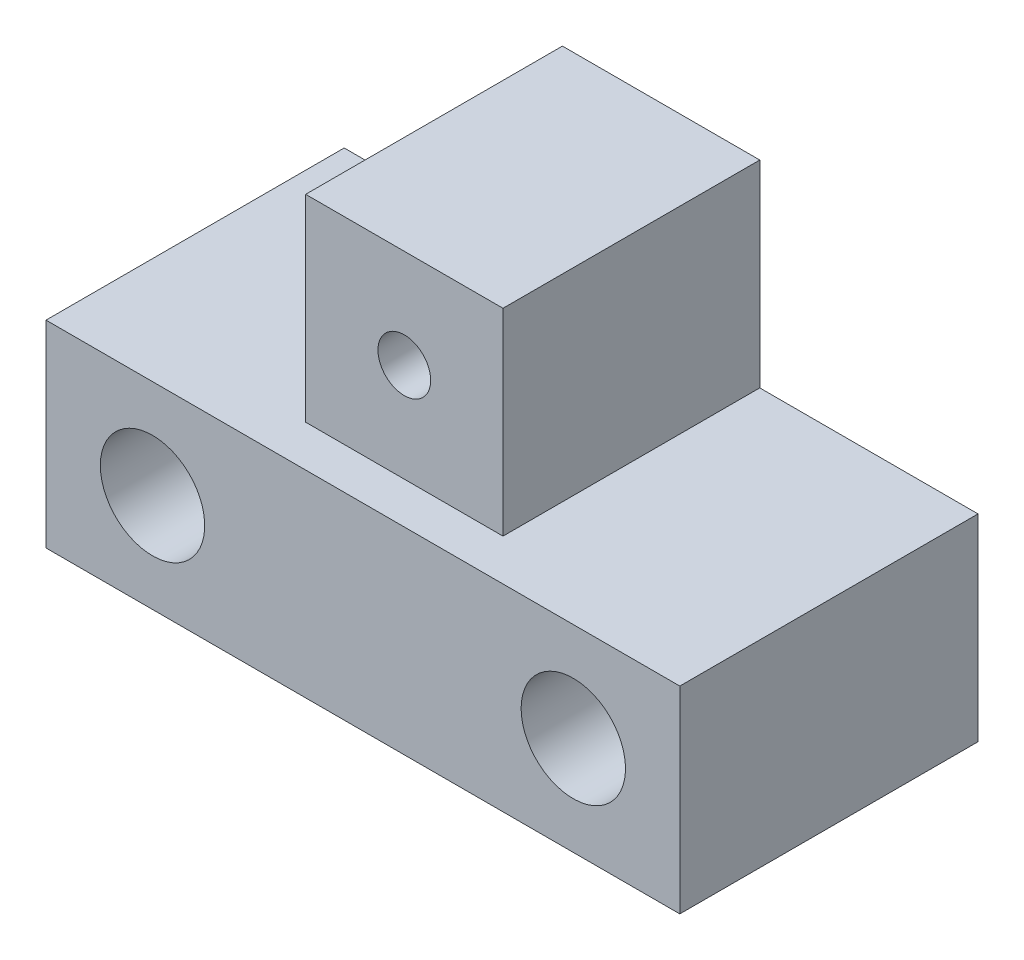
ISO-10303-21;
HEADER;
FILE_DESCRIPTION(('STEP AP214'),'2;1');
FILE_NAME('part.step','',(''),(''),'','','');
FILE_SCHEMA(('AUTOMOTIVE_DESIGN { 1 0 10303 214 1 1 1 1 }'));
ENDSEC;
DATA;
#1=APPLICATION_CONTEXT('core data for automotive mechanical design processes');
#2=APPLICATION_PROTOCOL_DEFINITION('international standard','automotive_design',2000,#1);
#3=PRODUCT_CONTEXT('',#1,'mechanical');
#4=PRODUCT('Part','Part','',(#3));
#5=PRODUCT_RELATED_PRODUCT_CATEGORY('part','',(#4));
#6=PRODUCT_DEFINITION_FORMATION('','',#4);
#7=PRODUCT_DEFINITION_CONTEXT('part definition',#1,'design');
#8=PRODUCT_DEFINITION('design','',#6,#7);
#9=PRODUCT_DEFINITION_SHAPE('','',#8);
#10=(LENGTH_UNIT() NAMED_UNIT(*) SI_UNIT(.MILLI.,.METRE.));
#11=(NAMED_UNIT(*) PLANE_ANGLE_UNIT() SI_UNIT($,.RADIAN.));
#12=(NAMED_UNIT(*) SI_UNIT($,.STERADIAN.) SOLID_ANGLE_UNIT());
#13=UNCERTAINTY_MEASURE_WITH_UNIT(LENGTH_MEASURE(1.E-05),#10,'distance_accuracy_value','');
#14=(GEOMETRIC_REPRESENTATION_CONTEXT(3) GLOBAL_UNCERTAINTY_ASSIGNED_CONTEXT((#13)) GLOBAL_UNIT_ASSIGNED_CONTEXT((#10,
#11,#12)) REPRESENTATION_CONTEXT('',''));
#15=CARTESIAN_POINT('',(0.,0.,0.));
#16=DIRECTION('',(0.,0.,1.));
#17=DIRECTION('',(1.,0.,0.));
#18=AXIS2_PLACEMENT_3D('',#15,#16,#17);
#19=CARTESIAN_POINT('',(0.,0.,9.));
#20=DIRECTION('',(0.,0.,-1.));
#21=DIRECTION('',(-1.,0.,0.));
#22=AXIS2_PLACEMENT_3D('',#19,#20,#21);
#23=PLANE('',#22);
#24=CARTESIAN_POINT('',(15.915,2.97828432001349,9.));
#25=DIRECTION('',(0.,0.,-1.));
#26=DIRECTION('',(-1.,0.,0.));
#27=AXIS2_PLACEMENT_3D('',#24,#25,#26);
#28=CIRCLE('',#27,1.575);
#29=CARTESIAN_POINT('',(14.34,2.97828432001349,9.));
#30=VERTEX_POINT('',#29);
#31=EDGE_CURVE('E176',#30,#30,#28,.T.);
#32=ORIENTED_EDGE('',*,*,#31,.T.);
#33=EDGE_LOOP('',(#32));
#34=FACE_BOUND('',#33,.T.);
#35=CARTESIAN_POINT('',(3.215,2.97828432001349,9.));
#36=DIRECTION('',(0.,0.,-1.));
#37=DIRECTION('',(-1.,0.,0.));
#38=AXIS2_PLACEMENT_3D('',#35,#36,#37);
#39=CIRCLE('',#38,1.575);
#40=CARTESIAN_POINT('',(1.64,2.97828432001349,9.));
#41=VERTEX_POINT('',#40);
#42=EDGE_CURVE('E125',#41,#41,#39,.T.);
#43=ORIENTED_EDGE('',*,*,#42,.T.);
#44=EDGE_LOOP('',(#43));
#45=FACE_BOUND('',#44,.T.);
#46=DIRECTION('',(-1.,0.,0.));
#47=VECTOR('',#46,1.);
#48=CARTESIAN_POINT('',(12.5432843200135,5.95656864002698,9.));
#49=LINE('',#48,#47);
#50=CARTESIAN_POINT('',(19.13,5.95656864002698,9.));
#51=VERTEX_POINT('',#50);
#52=CARTESIAN_POINT('',(0.,5.95656864002698,9.));
#53=VERTEX_POINT('',#52);
#54=EDGE_CURVE('E165',#51,#53,#49,.T.);
#55=ORIENTED_EDGE('',*,*,#54,.T.);
#56=DIRECTION('',(0.,-1.,0.));
#57=VECTOR('',#56,1.);
#58=CARTESIAN_POINT('',(0.,0.,9.));
#59=LINE('',#58,#57);
#60=CARTESIAN_POINT('',(0.,0.,9.));
#61=VERTEX_POINT('',#60);
#62=EDGE_CURVE('E62',#53,#61,#59,.T.);
#63=ORIENTED_EDGE('',*,*,#62,.T.);
#64=DIRECTION('',(1.,0.,0.));
#65=VECTOR('',#64,1.);
#66=CARTESIAN_POINT('',(19.13,0.,9.));
#67=LINE('',#66,#65);
#68=CARTESIAN_POINT('',(19.13,0.,9.));
#69=VERTEX_POINT('',#68);
#70=EDGE_CURVE('E146',#61,#69,#67,.T.);
#71=ORIENTED_EDGE('',*,*,#70,.T.);
#72=DIRECTION('',(0.,1.,0.));
#73=VECTOR('',#72,1.);
#74=CARTESIAN_POINT('',(19.13,5.95656864002698,9.));
#75=LINE('',#74,#73);
#76=EDGE_CURVE('E100',#69,#51,#75,.T.);
#77=ORIENTED_EDGE('',*,*,#76,.T.);
#78=EDGE_LOOP('',(#55,#63,#71,#77));
#79=FACE_BOUND('',#78,.T.);
#80=ADVANCED_FACE('F37',(#34,#45,#79),#23,.F.);
#81=CARTESIAN_POINT('',(0.,0.,0.));
#82=DIRECTION('',(0.,0.,-1.));
#83=DIRECTION('',(-1.,0.,0.));
#84=AXIS2_PLACEMENT_3D('',#81,#82,#83);
#85=PLANE('',#84);
#86=CARTESIAN_POINT('',(15.915,2.97828432001349,0.));
#87=DIRECTION('',(0.,0.,-1.));
#88=DIRECTION('',(-1.,0.,0.));
#89=AXIS2_PLACEMENT_3D('',#86,#87,#88);
#90=CIRCLE('',#89,1.575);
#91=CARTESIAN_POINT('',(14.34,2.97828432001349,0.));
#92=VERTEX_POINT('',#91);
#93=EDGE_CURVE('E179',#92,#92,#90,.T.);
#94=ORIENTED_EDGE('',*,*,#93,.F.);
#95=EDGE_LOOP('',(#94));
#96=FACE_BOUND('',#95,.T.);
#97=CARTESIAN_POINT('',(3.215,2.97828432001349,0.));
#98=DIRECTION('',(0.,0.,-1.));
#99=DIRECTION('',(-1.,0.,0.));
#100=AXIS2_PLACEMENT_3D('',#97,#98,#99);
#101=CIRCLE('',#100,1.575);
#102=CARTESIAN_POINT('',(1.64,2.97828432001349,0.));
#103=VERTEX_POINT('',#102);
#104=EDGE_CURVE('E173',#103,#103,#101,.T.);
#105=ORIENTED_EDGE('',*,*,#104,.F.);
#106=EDGE_LOOP('',(#105));
#107=FACE_BOUND('',#106,.T.);
#108=DIRECTION('',(1.,0.,0.));
#109=VECTOR('',#108,1.);
#110=CARTESIAN_POINT('',(19.13,0.,0.));
#111=LINE('',#110,#109);
#112=CARTESIAN_POINT('',(0.,0.,0.));
#113=VERTEX_POINT('',#112);
#114=CARTESIAN_POINT('',(19.13,0.,0.));
#115=VERTEX_POINT('',#114);
#116=EDGE_CURVE('E160',#113,#115,#111,.T.);
#117=ORIENTED_EDGE('',*,*,#116,.F.);
#118=DIRECTION('',(0.,-1.,0.));
#119=VECTOR('',#118,1.);
#120=CARTESIAN_POINT('',(0.,0.,0.));
#121=LINE('',#120,#119);
#122=CARTESIAN_POINT('',(0.,5.95656864002698,0.));
#123=VERTEX_POINT('',#122);
#124=EDGE_CURVE('E93',#123,#113,#121,.T.);
#125=ORIENTED_EDGE('',*,*,#124,.F.);
#126=DIRECTION('',(-1.,0.,0.));
#127=VECTOR('',#126,1.);
#128=CARTESIAN_POINT('',(0.,5.95656864002698,0.));
#129=LINE('',#128,#127);
#130=CARTESIAN_POINT('',(6.58671567998651,5.95656864002698,0.));
#131=VERTEX_POINT('',#130);
#132=EDGE_CURVE('E147',#131,#123,#129,.T.);
#133=ORIENTED_EDGE('',*,*,#132,.F.);
#134=DIRECTION('',(0.,-1.,0.));
#135=VECTOR('',#134,1.);
#136=CARTESIAN_POINT('',(6.58671567998651,5.95656864002698,0.));
#137=LINE('',#136,#135);
#138=CARTESIAN_POINT('',(6.58671567998651,11.913137280054,0.));
#139=VERTEX_POINT('',#138);
#140=EDGE_CURVE('E149',#139,#131,#137,.T.);
#141=ORIENTED_EDGE('',*,*,#140,.F.);
#142=DIRECTION('',(-1.,0.,0.));
#143=VECTOR('',#142,1.);
#144=CARTESIAN_POINT('',(6.58671567998651,11.913137280054,0.));
#145=LINE('',#144,#143);
#146=CARTESIAN_POINT('',(12.5432843200135,11.913137280054,0.));
#147=VERTEX_POINT('',#146);
#148=EDGE_CURVE('E152',#147,#139,#145,.T.);
#149=ORIENTED_EDGE('',*,*,#148,.F.);
#150=DIRECTION('',(0.,1.,0.));
#151=VECTOR('',#150,1.);
#152=CARTESIAN_POINT('',(12.5432843200135,11.913137280054,0.));
#153=LINE('',#152,#151);
#154=CARTESIAN_POINT('',(12.5432843200135,5.95656864002698,0.));
#155=VERTEX_POINT('',#154);
#156=EDGE_CURVE('E155',#155,#147,#153,.T.);
#157=ORIENTED_EDGE('',*,*,#156,.F.);
#158=DIRECTION('',(-1.,0.,0.));
#159=VECTOR('',#158,1.);
#160=CARTESIAN_POINT('',(12.5432843200135,5.95656864002698,0.));
#161=LINE('',#160,#159);
#162=CARTESIAN_POINT('',(19.13,5.95656864002698,0.));
#163=VERTEX_POINT('',#162);
#164=EDGE_CURVE('E131',#163,#155,#161,.T.);
#165=ORIENTED_EDGE('',*,*,#164,.F.);
#166=DIRECTION('',(0.,1.,0.));
#167=VECTOR('',#166,1.);
#168=CARTESIAN_POINT('',(19.13,5.95656864002698,0.));
#169=LINE('',#168,#167);
#170=EDGE_CURVE('E158',#115,#163,#169,.T.);
#171=ORIENTED_EDGE('',*,*,#170,.F.);
#172=EDGE_LOOP('',(#117,#125,#133,#141,#149,#157,#165,#171));
#173=FACE_BOUND('',#172,.T.);
#174=CARTESIAN_POINT('',(9.565,8.93485296004046,0.));
#175=DIRECTION('',(0.,0.,1.));
#176=DIRECTION('',(1.,0.,0.));
#177=AXIS2_PLACEMENT_3D('',#174,#175,#176);
#178=CIRCLE('',#177,0.795000000000001);
#179=CARTESIAN_POINT('',(10.36,8.93485296004046,0.));
#180=VERTEX_POINT('',#179);
#181=EDGE_CURVE('E163',#180,#180,#178,.T.);
#182=ORIENTED_EDGE('',*,*,#181,.T.);
#183=EDGE_LOOP('',(#182));
#184=FACE_BOUND('',#183,.T.);
#185=ADVANCED_FACE('F194',(#96,#107,#173,#184),#85,.T.);
#186=CARTESIAN_POINT('',(19.13,0.,9.));
#187=DIRECTION('',(0.,1.,0.));
#188=DIRECTION('',(0.,0.,1.));
#189=AXIS2_PLACEMENT_3D('',#186,#187,#188);
#190=PLANE('',#189);
#191=ORIENTED_EDGE('',*,*,#116,.T.);
#192=DIRECTION('',(0.,0.,-1.));
#193=VECTOR('',#192,1.);
#194=CARTESIAN_POINT('',(19.13,0.,9.));
#195=LINE('',#194,#193);
#196=EDGE_CURVE('E11',#69,#115,#195,.T.);
#197=ORIENTED_EDGE('',*,*,#196,.F.);
#198=ORIENTED_EDGE('',*,*,#70,.F.);
#199=DIRECTION('',(0.,0.,-1.));
#200=VECTOR('',#199,1.);
#201=CARTESIAN_POINT('',(0.,0.,9.));
#202=LINE('',#201,#200);
#203=EDGE_CURVE('E143',#61,#113,#202,.T.);
#204=ORIENTED_EDGE('',*,*,#203,.T.);
#205=EDGE_LOOP('',(#191,#197,#198,#204));
#206=FACE_BOUND('',#205,.T.);
#207=ADVANCED_FACE('F39',(#206),#190,.F.);
#208=CARTESIAN_POINT('',(19.13,5.95656864002698,9.));
#209=DIRECTION('',(-1.,0.,0.));
#210=DIRECTION('',(0.,0.,1.));
#211=AXIS2_PLACEMENT_3D('',#208,#209,#210);
#212=PLANE('',#211);
#213=ORIENTED_EDGE('',*,*,#170,.T.);
#214=DIRECTION('',(0.,0.,-1.));
#215=VECTOR('',#214,1.);
#216=CARTESIAN_POINT('',(19.13,5.95656864002698,9.));
#217=LINE('',#216,#215);
#218=EDGE_CURVE('E46',#51,#163,#217,.T.);
#219=ORIENTED_EDGE('',*,*,#218,.F.);
#220=ORIENTED_EDGE('',*,*,#76,.F.);
#221=ORIENTED_EDGE('',*,*,#196,.T.);
#222=EDGE_LOOP('',(#213,#219,#220,#221));
#223=FACE_BOUND('',#222,.T.);
#224=ADVANCED_FACE('F233',(#223),#212,.F.);
#225=CARTESIAN_POINT('',(12.5432843200135,11.913137280054,9.));
#226=DIRECTION('',(-1.,0.,0.));
#227=DIRECTION('',(0.,-1.,0.));
#228=AXIS2_PLACEMENT_3D('',#225,#226,#227);
#229=PLANE('',#228);
#230=DIRECTION('',(0.,0.,-1.));
#231=VECTOR('',#230,1.);
#232=CARTESIAN_POINT('',(12.5432843200135,11.913137280054,9.));
#233=LINE('',#232,#231);
#234=CARTESIAN_POINT('',(12.5432843200135,11.913137280054,7.75));
#235=VERTEX_POINT('',#234);
#236=EDGE_CURVE('E124',#235,#147,#233,.T.);
#237=ORIENTED_EDGE('',*,*,#236,.F.);
#238=DIRECTION('',(0.,1.,0.));
#239=VECTOR('',#238,1.);
#240=CARTESIAN_POINT('',(12.5432843200135,5.95656864002698,7.75));
#241=LINE('',#240,#239);
#242=CARTESIAN_POINT('',(12.5432843200135,5.95656864002698,7.75));
#243=VERTEX_POINT('',#242);
#244=EDGE_CURVE('E111',#243,#235,#241,.T.);
#245=ORIENTED_EDGE('',*,*,#244,.F.);
#246=DIRECTION('',(0.,0.,-1.));
#247=VECTOR('',#246,1.);
#248=CARTESIAN_POINT('',(12.5432843200135,5.95656864002698,9.));
#249=LINE('',#248,#247);
#250=EDGE_CURVE('E122',#243,#155,#249,.T.);
#251=ORIENTED_EDGE('',*,*,#250,.T.);
#252=ORIENTED_EDGE('',*,*,#156,.T.);
#253=EDGE_LOOP('',(#237,#245,#251,#252));
#254=FACE_BOUND('',#253,.T.);
#255=ADVANCED_FACE('F120',(#254),#229,.F.);
#256=CARTESIAN_POINT('',(6.58671567998651,11.913137280054,9.));
#257=DIRECTION('',(0.,-1.,0.));
#258=DIRECTION('',(0.,0.,-1.));
#259=AXIS2_PLACEMENT_3D('',#256,#257,#258);
#260=PLANE('',#259);
#261=DIRECTION('',(0.,0.,-1.));
#262=VECTOR('',#261,1.);
#263=CARTESIAN_POINT('',(6.58671567998651,11.913137280054,9.));
#264=LINE('',#263,#262);
#265=CARTESIAN_POINT('',(6.58671567998651,11.913137280054,7.75));
#266=VERTEX_POINT('',#265);
#267=EDGE_CURVE('E135',#266,#139,#264,.T.);
#268=ORIENTED_EDGE('',*,*,#267,.F.);
#269=DIRECTION('',(1.,0.,0.));
#270=VECTOR('',#269,1.);
#271=CARTESIAN_POINT('',(0.,11.9131372800539,7.75));
#272=LINE('',#271,#270);
#273=EDGE_CURVE('E116',#266,#235,#272,.T.);
#274=ORIENTED_EDGE('',*,*,#273,.T.);
#275=ORIENTED_EDGE('',*,*,#236,.T.);
#276=ORIENTED_EDGE('',*,*,#148,.T.);
#277=EDGE_LOOP('',(#268,#274,#275,#276));
#278=FACE_BOUND('',#277,.T.);
#279=ADVANCED_FACE('F227',(#278),#260,.F.);
#280=CARTESIAN_POINT('',(6.58671567998651,5.95656864002698,9.));
#281=DIRECTION('',(1.,0.,0.));
#282=DIRECTION('',(0.,1.,0.));
#283=AXIS2_PLACEMENT_3D('',#280,#281,#282);
#284=PLANE('',#283);
#285=DIRECTION('',(0.,0.,-1.));
#286=VECTOR('',#285,1.);
#287=CARTESIAN_POINT('',(6.58671567998651,5.95656864002698,9.));
#288=LINE('',#287,#286);
#289=CARTESIAN_POINT('',(6.58671567998651,5.95656864002698,7.75));
#290=VERTEX_POINT('',#289);
#291=EDGE_CURVE('E139',#290,#131,#288,.T.);
#292=ORIENTED_EDGE('',*,*,#291,.F.);
#293=DIRECTION('',(0.,1.,0.));
#294=VECTOR('',#293,1.);
#295=CARTESIAN_POINT('',(6.58671567998651,5.95656864002698,7.75));
#296=LINE('',#295,#294);
#297=EDGE_CURVE('E114',#290,#266,#296,.T.);
#298=ORIENTED_EDGE('',*,*,#297,.T.);
#299=ORIENTED_EDGE('',*,*,#267,.T.);
#300=ORIENTED_EDGE('',*,*,#140,.T.);
#301=EDGE_LOOP('',(#292,#298,#299,#300));
#302=FACE_BOUND('',#301,.T.);
#303=ADVANCED_FACE('F224',(#302),#284,.F.);
#304=CARTESIAN_POINT('',(0.,5.95656864002698,9.));
#305=DIRECTION('',(0.,-1.,0.));
#306=DIRECTION('',(0.,0.,-1.));
#307=AXIS2_PLACEMENT_3D('',#304,#305,#306);
#308=PLANE('',#307);
#309=ORIENTED_EDGE('',*,*,#132,.T.);
#310=DIRECTION('',(0.,0.,-1.));
#311=VECTOR('',#310,1.);
#312=CARTESIAN_POINT('',(0.,5.95656864002698,9.));
#313=LINE('',#312,#311);
#314=EDGE_CURVE('E141',#53,#123,#313,.T.);
#315=ORIENTED_EDGE('',*,*,#314,.F.);
#316=ORIENTED_EDGE('',*,*,#54,.F.);
#317=ORIENTED_EDGE('',*,*,#218,.T.);
#318=ORIENTED_EDGE('',*,*,#164,.T.);
#319=ORIENTED_EDGE('',*,*,#250,.F.);
#320=DIRECTION('',(1.,0.,0.));
#321=VECTOR('',#320,1.);
#322=CARTESIAN_POINT('',(0.,5.95656864002697,7.75));
#323=LINE('',#322,#321);
#324=EDGE_CURVE('E53',#290,#243,#323,.T.);
#325=ORIENTED_EDGE('',*,*,#324,.F.);
#326=ORIENTED_EDGE('',*,*,#291,.T.);
#327=EDGE_LOOP('',(#309,#315,#316,#317,#318,#319,#325,#326));
#328=FACE_BOUND('',#327,.T.);
#329=ADVANCED_FACE('F128',(#328),#308,.F.);
#330=CARTESIAN_POINT('',(0.,0.,9.));
#331=DIRECTION('',(1.,0.,0.));
#332=DIRECTION('',(0.,0.,-1.));
#333=AXIS2_PLACEMENT_3D('',#330,#331,#332);
#334=PLANE('',#333);
#335=ORIENTED_EDGE('',*,*,#124,.T.);
#336=ORIENTED_EDGE('',*,*,#203,.F.);
#337=ORIENTED_EDGE('',*,*,#62,.F.);
#338=ORIENTED_EDGE('',*,*,#314,.T.);
#339=EDGE_LOOP('',(#335,#336,#337,#338));
#340=FACE_BOUND('',#339,.T.);
#341=ADVANCED_FACE('F206',(#340),#334,.F.);
#342=CARTESIAN_POINT('',(9.565,8.93485296004046,9.));
#343=DIRECTION('',(0.,0.,-1.));
#344=DIRECTION('',(-1.,0.,0.));
#345=AXIS2_PLACEMENT_3D('',#342,#343,#344);
#346=CYLINDRICAL_SURFACE('',#345,0.795000000000001);
#347=CARTESIAN_POINT('',(9.565,8.93485296004046,7.75));
#348=DIRECTION('',(0.,0.,-1.));
#349=DIRECTION('',(-1.,0.,0.));
#350=AXIS2_PLACEMENT_3D('',#347,#348,#349);
#351=CIRCLE('',#350,0.795000000000001);
#352=CARTESIAN_POINT('',(8.77,8.93485296004046,7.75));
#353=VERTEX_POINT('',#352);
#354=EDGE_CURVE('E41',#353,#353,#351,.T.);
#355=ORIENTED_EDGE('',*,*,#354,.F.);
#356=EDGE_LOOP('',(#355));
#357=FACE_BOUND('',#356,.T.);
#358=ORIENTED_EDGE('',*,*,#181,.F.);
#359=EDGE_LOOP('',(#358));
#360=FACE_BOUND('',#359,.T.);
#361=ADVANCED_FACE('F204',(#357,#360),#346,.F.);
#362=CARTESIAN_POINT('',(0.,5.95656864002697,7.75));
#363=DIRECTION('',(0.,0.,-1.));
#364=DIRECTION('',(-1.,0.,0.));
#365=AXIS2_PLACEMENT_3D('',#362,#363,#364);
#366=PLANE('',#365);
#367=ORIENTED_EDGE('',*,*,#354,.T.);
#368=EDGE_LOOP('',(#367));
#369=FACE_BOUND('',#368,.T.);
#370=ORIENTED_EDGE('',*,*,#324,.T.);
#371=ORIENTED_EDGE('',*,*,#244,.T.);
#372=ORIENTED_EDGE('',*,*,#273,.F.);
#373=ORIENTED_EDGE('',*,*,#297,.F.);
#374=EDGE_LOOP('',(#370,#371,#372,#373));
#375=FACE_BOUND('',#374,.T.);
#376=ADVANCED_FACE('F110',(#369,#375),#366,.F.);
#377=CARTESIAN_POINT('',(3.215,2.97828432001349,9.));
#378=DIRECTION('',(0.,0.,-1.));
#379=DIRECTION('',(-1.,0.,0.));
#380=AXIS2_PLACEMENT_3D('',#377,#378,#379);
#381=CYLINDRICAL_SURFACE('',#380,1.575);
#382=ORIENTED_EDGE('',*,*,#42,.F.);
#383=EDGE_LOOP('',(#382));
#384=FACE_BOUND('',#383,.T.);
#385=ORIENTED_EDGE('',*,*,#104,.T.);
#386=EDGE_LOOP('',(#385));
#387=FACE_BOUND('',#386,.T.);
#388=ADVANCED_FACE('F190',(#384,#387),#381,.F.);
#389=CARTESIAN_POINT('',(15.915,2.97828432001349,9.));
#390=DIRECTION('',(0.,0.,-1.));
#391=DIRECTION('',(-1.,0.,0.));
#392=AXIS2_PLACEMENT_3D('',#389,#390,#391);
#393=CYLINDRICAL_SURFACE('',#392,1.575);
#394=ORIENTED_EDGE('',*,*,#31,.F.);
#395=EDGE_LOOP('',(#394));
#396=FACE_BOUND('',#395,.T.);
#397=ORIENTED_EDGE('',*,*,#93,.T.);
#398=EDGE_LOOP('',(#397));
#399=FACE_BOUND('',#398,.T.);
#400=ADVANCED_FACE('F187',(#396,#399),#393,.F.);
#401=CLOSED_SHELL('',(#80,#185,#207,#224,#255,#279,#303,#329,#341,#361,#376,#388,#400));
#402=MANIFOLD_SOLID_BREP('B2',#401);
#403=ADVANCED_BREP_SHAPE_REPRESENTATION('',(#18,#402),#14);
#404=SHAPE_DEFINITION_REPRESENTATION(#9,#403);
ENDSEC;
END-ISO-10303-21;
